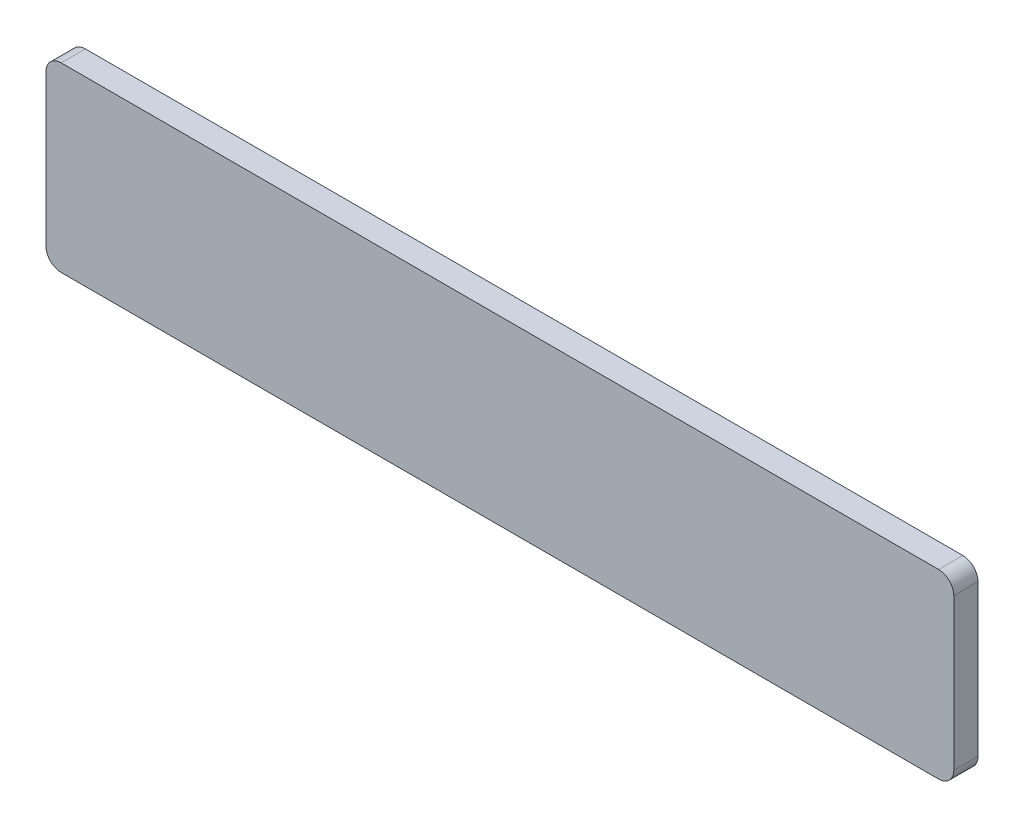
ISO-10303-21;
HEADER;
FILE_DESCRIPTION(('STEP AP214'),'2;1');
FILE_NAME('part.step','',(''),(''),'','','');
FILE_SCHEMA(('AUTOMOTIVE_DESIGN { 1 0 10303 214 1 1 1 1 }'));
ENDSEC;
DATA;
#1=APPLICATION_CONTEXT('core data for automotive mechanical design processes');
#2=APPLICATION_PROTOCOL_DEFINITION('international standard','automotive_design',2000,#1);
#3=PRODUCT_CONTEXT('',#1,'mechanical');
#4=PRODUCT('Part','Part','',(#3));
#5=PRODUCT_RELATED_PRODUCT_CATEGORY('part','',(#4));
#6=PRODUCT_DEFINITION_FORMATION('','',#4);
#7=PRODUCT_DEFINITION_CONTEXT('part definition',#1,'design');
#8=PRODUCT_DEFINITION('design','',#6,#7);
#9=PRODUCT_DEFINITION_SHAPE('','',#8);
#10=(LENGTH_UNIT() NAMED_UNIT(*) SI_UNIT(.MILLI.,.METRE.));
#11=(NAMED_UNIT(*) PLANE_ANGLE_UNIT() SI_UNIT($,.RADIAN.));
#12=(NAMED_UNIT(*) SI_UNIT($,.STERADIAN.) SOLID_ANGLE_UNIT());
#13=UNCERTAINTY_MEASURE_WITH_UNIT(LENGTH_MEASURE(1.E-05),#10,'distance_accuracy_value','');
#14=(GEOMETRIC_REPRESENTATION_CONTEXT(3) GLOBAL_UNCERTAINTY_ASSIGNED_CONTEXT((#13)) GLOBAL_UNIT_ASSIGNED_CONTEXT((#10,
#11,#12)) REPRESENTATION_CONTEXT('',''));
#15=CARTESIAN_POINT('',(0.,0.,0.));
#16=DIRECTION('',(0.,0.,1.));
#17=DIRECTION('',(1.,0.,0.));
#18=AXIS2_PLACEMENT_3D('',#15,#16,#17);
#19=CARTESIAN_POINT('',(29.5,0.5,0.8));
#20=DIRECTION('',(0.,0.,-1.));
#21=DIRECTION('',(-1.,0.,0.));
#22=AXIS2_PLACEMENT_3D('',#19,#20,#21);
#23=CYLINDRICAL_SURFACE('',#22,0.5);
#24=CARTESIAN_POINT('',(29.5,0.5,0.));
#25=DIRECTION('',(0.,0.,1.));
#26=DIRECTION('',(1.,0.,0.));
#27=AXIS2_PLACEMENT_3D('',#24,#25,#26);
#28=CIRCLE('',#27,0.5);
#29=CARTESIAN_POINT('',(29.5,0.,0.));
#30=VERTEX_POINT('',#29);
#31=CARTESIAN_POINT('',(30.,0.500000000000004,0.));
#32=VERTEX_POINT('',#31);
#33=EDGE_CURVE('E140',#30,#32,#28,.T.);
#34=ORIENTED_EDGE('',*,*,#33,.T.);
#35=DIRECTION('',(0.,0.,-1.));
#36=VECTOR('',#35,1.);
#37=CARTESIAN_POINT('',(30.,0.500000000000004,0.8));
#38=LINE('',#37,#36);
#39=CARTESIAN_POINT('',(30.,0.500000000000004,0.8));
#40=VERTEX_POINT('',#39);
#41=EDGE_CURVE('E11',#40,#32,#38,.T.);
#42=ORIENTED_EDGE('',*,*,#41,.F.);
#43=CARTESIAN_POINT('',(29.5,0.5,0.8));
#44=DIRECTION('',(0.,0.,1.));
#45=DIRECTION('',(1.,0.,0.));
#46=AXIS2_PLACEMENT_3D('',#43,#44,#45);
#47=CIRCLE('',#46,0.5);
#48=CARTESIAN_POINT('',(29.5,0.,0.8));
#49=VERTEX_POINT('',#48);
#50=EDGE_CURVE('E162',#49,#40,#47,.T.);
#51=ORIENTED_EDGE('',*,*,#50,.F.);
#52=DIRECTION('',(0.,0.,-1.));
#53=VECTOR('',#52,1.);
#54=CARTESIAN_POINT('',(29.5,0.,0.8));
#55=LINE('',#54,#53);
#56=EDGE_CURVE('E136',#49,#30,#55,.T.);
#57=ORIENTED_EDGE('',*,*,#56,.T.);
#58=EDGE_LOOP('',(#34,#42,#51,#57));
#59=FACE_BOUND('',#58,.T.);
#60=ADVANCED_FACE('F39',(#59),#23,.T.);
#61=CARTESIAN_POINT('',(30.,0.500000000000004,0.8));
#62=DIRECTION('',(-1.,0.,0.));
#63=DIRECTION('',(0.,0.,1.));
#64=AXIS2_PLACEMENT_3D('',#61,#62,#63);
#65=PLANE('',#64);
#66=DIRECTION('',(0.,1.,0.));
#67=VECTOR('',#66,1.);
#68=CARTESIAN_POINT('',(30.,0.500000000000004,0.));
#69=LINE('',#68,#67);
#70=CARTESIAN_POINT('',(30.,5.5,0.));
#71=VERTEX_POINT('',#70);
#72=EDGE_CURVE('E144',#32,#71,#69,.T.);
#73=ORIENTED_EDGE('',*,*,#72,.T.);
#74=DIRECTION('',(0.,0.,-1.));
#75=VECTOR('',#74,1.);
#76=CARTESIAN_POINT('',(30.,5.5,0.8));
#77=LINE('',#76,#75);
#78=CARTESIAN_POINT('',(30.,5.5,0.8));
#79=VERTEX_POINT('',#78);
#80=EDGE_CURVE('E48',#79,#71,#77,.T.);
#81=ORIENTED_EDGE('',*,*,#80,.F.);
#82=DIRECTION('',(0.,1.,0.));
#83=VECTOR('',#82,1.);
#84=CARTESIAN_POINT('',(30.,0.500000000000004,0.8));
#85=LINE('',#84,#83);
#86=EDGE_CURVE('E99',#40,#79,#85,.T.);
#87=ORIENTED_EDGE('',*,*,#86,.F.);
#88=ORIENTED_EDGE('',*,*,#41,.T.);
#89=EDGE_LOOP('',(#73,#81,#87,#88));
#90=FACE_BOUND('',#89,.T.);
#91=ADVANCED_FACE('F208',(#90),#65,.F.);
#92=CARTESIAN_POINT('',(29.5,5.5,0.8));
#93=DIRECTION('',(0.,0.,-1.));
#94=DIRECTION('',(-1.,0.,0.));
#95=AXIS2_PLACEMENT_3D('',#92,#93,#94);
#96=CYLINDRICAL_SURFACE('',#95,0.5);
#97=CARTESIAN_POINT('',(29.5,5.5,0.));
#98=DIRECTION('',(0.,0.,1.));
#99=DIRECTION('',(-1.,0.,0.));
#100=AXIS2_PLACEMENT_3D('',#97,#98,#99);
#101=CIRCLE('',#100,0.5);
#102=CARTESIAN_POINT('',(29.5,6.,0.));
#103=VERTEX_POINT('',#102);
#104=EDGE_CURVE('E147',#71,#103,#101,.T.);
#105=ORIENTED_EDGE('',*,*,#104,.T.);
#106=DIRECTION('',(0.,0.,-1.));
#107=VECTOR('',#106,1.);
#108=CARTESIAN_POINT('',(29.5,6.,0.8));
#109=LINE('',#108,#107);
#110=CARTESIAN_POINT('',(29.5,6.,0.8));
#111=VERTEX_POINT('',#110);
#112=EDGE_CURVE('E173',#111,#103,#109,.T.);
#113=ORIENTED_EDGE('',*,*,#112,.F.);
#114=CARTESIAN_POINT('',(29.5,5.5,0.8));
#115=DIRECTION('',(0.,0.,1.));
#116=DIRECTION('',(-1.,0.,0.));
#117=AXIS2_PLACEMENT_3D('',#114,#115,#116);
#118=CIRCLE('',#117,0.5);
#119=EDGE_CURVE('E183',#79,#111,#118,.T.);
#120=ORIENTED_EDGE('',*,*,#119,.F.);
#121=ORIENTED_EDGE('',*,*,#80,.T.);
#122=EDGE_LOOP('',(#105,#113,#120,#121));
#123=FACE_BOUND('',#122,.T.);
#124=ADVANCED_FACE('F181',(#123),#96,.T.);
#125=CARTESIAN_POINT('',(0.500000000000004,6.,0.8));
#126=DIRECTION('',(0.,-1.,0.));
#127=DIRECTION('',(0.,0.,-1.));
#128=AXIS2_PLACEMENT_3D('',#125,#126,#127);
#129=PLANE('',#128);
#130=DIRECTION('',(-1.,0.,0.));
#131=VECTOR('',#130,1.);
#132=CARTESIAN_POINT('',(0.500000000000004,6.,0.));
#133=LINE('',#132,#131);
#134=CARTESIAN_POINT('',(0.500000000000003,6.,0.));
#135=VERTEX_POINT('',#134);
#136=EDGE_CURVE('E150',#103,#135,#133,.T.);
#137=ORIENTED_EDGE('',*,*,#136,.T.);
#138=DIRECTION('',(0.,0.,-1.));
#139=VECTOR('',#138,1.);
#140=CARTESIAN_POINT('',(0.500000000000003,6.,0.8));
#141=LINE('',#140,#139);
#142=CARTESIAN_POINT('',(0.500000000000003,6.,0.8));
#143=VERTEX_POINT('',#142);
#144=EDGE_CURVE('E169',#143,#135,#141,.T.);
#145=ORIENTED_EDGE('',*,*,#144,.F.);
#146=DIRECTION('',(-1.,0.,0.));
#147=VECTOR('',#146,1.);
#148=CARTESIAN_POINT('',(0.500000000000004,6.,0.8));
#149=LINE('',#148,#147);
#150=EDGE_CURVE('E196',#111,#143,#149,.T.);
#151=ORIENTED_EDGE('',*,*,#150,.F.);
#152=ORIENTED_EDGE('',*,*,#112,.T.);
#153=EDGE_LOOP('',(#137,#145,#151,#152));
#154=FACE_BOUND('',#153,.T.);
#155=ADVANCED_FACE('F191',(#154),#129,.F.);
#156=CARTESIAN_POINT('',(0.5,5.5,0.8));
#157=DIRECTION('',(0.,0.,-1.));
#158=DIRECTION('',(-1.,0.,0.));
#159=AXIS2_PLACEMENT_3D('',#156,#157,#158);
#160=CYLINDRICAL_SURFACE('',#159,0.5);
#161=CARTESIAN_POINT('',(0.5,5.5,0.));
#162=DIRECTION('',(0.,0.,1.));
#163=DIRECTION('',(-1.,0.,0.));
#164=AXIS2_PLACEMENT_3D('',#161,#162,#163);
#165=CIRCLE('',#164,0.5);
#166=CARTESIAN_POINT('',(0.,5.5,0.));
#167=VERTEX_POINT('',#166);
#168=EDGE_CURVE('E153',#135,#167,#165,.T.);
#169=ORIENTED_EDGE('',*,*,#168,.T.);
#170=DIRECTION('',(0.,0.,-1.));
#171=VECTOR('',#170,1.);
#172=CARTESIAN_POINT('',(0.,5.5,0.8));
#173=LINE('',#172,#171);
#174=CARTESIAN_POINT('',(0.,5.5,0.8));
#175=VERTEX_POINT('',#174);
#176=EDGE_CURVE('E129',#175,#167,#173,.T.);
#177=ORIENTED_EDGE('',*,*,#176,.F.);
#178=CARTESIAN_POINT('',(0.5,5.5,0.8));
#179=DIRECTION('',(0.,0.,1.));
#180=DIRECTION('',(-1.,0.,0.));
#181=AXIS2_PLACEMENT_3D('',#178,#179,#180);
#182=CIRCLE('',#181,0.5);
#183=EDGE_CURVE('E118',#143,#175,#182,.T.);
#184=ORIENTED_EDGE('',*,*,#183,.F.);
#185=ORIENTED_EDGE('',*,*,#144,.T.);
#186=EDGE_LOOP('',(#169,#177,#184,#185));
#187=FACE_BOUND('',#186,.T.);
#188=ADVANCED_FACE('F194',(#187),#160,.T.);
#189=CARTESIAN_POINT('',(0.,0.500000000000004,0.8));
#190=DIRECTION('',(1.,0.,0.));
#191=DIRECTION('',(0.,0.,-1.));
#192=AXIS2_PLACEMENT_3D('',#189,#190,#191);
#193=PLANE('',#192);
#194=DIRECTION('',(0.,-1.,0.));
#195=VECTOR('',#194,1.);
#196=CARTESIAN_POINT('',(0.,0.500000000000004,0.));
#197=LINE('',#196,#195);
#198=CARTESIAN_POINT('',(0.,0.5,0.));
#199=VERTEX_POINT('',#198);
#200=EDGE_CURVE('E127',#167,#199,#197,.T.);
#201=ORIENTED_EDGE('',*,*,#200,.T.);
#202=DIRECTION('',(0.,0.,-1.));
#203=VECTOR('',#202,1.);
#204=CARTESIAN_POINT('',(0.,0.5,0.8));
#205=LINE('',#204,#203);
#206=CARTESIAN_POINT('',(0.,0.5,0.8));
#207=VERTEX_POINT('',#206);
#208=EDGE_CURVE('E124',#207,#199,#205,.T.);
#209=ORIENTED_EDGE('',*,*,#208,.F.);
#210=DIRECTION('',(0.,-1.,0.));
#211=VECTOR('',#210,1.);
#212=CARTESIAN_POINT('',(0.,0.500000000000004,0.8));
#213=LINE('',#212,#211);
#214=EDGE_CURVE('E112',#175,#207,#213,.T.);
#215=ORIENTED_EDGE('',*,*,#214,.F.);
#216=ORIENTED_EDGE('',*,*,#176,.T.);
#217=EDGE_LOOP('',(#201,#209,#215,#216));
#218=FACE_BOUND('',#217,.T.);
#219=ADVANCED_FACE('F125',(#218),#193,.F.);
#220=CARTESIAN_POINT('',(0.5,0.5,0.8));
#221=DIRECTION('',(0.,0.,-1.));
#222=DIRECTION('',(-1.,0.,0.));
#223=AXIS2_PLACEMENT_3D('',#220,#221,#222);
#224=CYLINDRICAL_SURFACE('',#223,0.5);
#225=CARTESIAN_POINT('',(0.5,0.5,0.));
#226=DIRECTION('',(0.,0.,1.));
#227=DIRECTION('',(-1.,0.,0.));
#228=AXIS2_PLACEMENT_3D('',#225,#226,#227);
#229=CIRCLE('',#228,0.5);
#230=CARTESIAN_POINT('',(0.500000000000004,0.,0.));
#231=VERTEX_POINT('',#230);
#232=EDGE_CURVE('E85',#199,#231,#229,.T.);
#233=ORIENTED_EDGE('',*,*,#232,.T.);
#234=DIRECTION('',(0.,0.,-1.));
#235=VECTOR('',#234,1.);
#236=CARTESIAN_POINT('',(0.500000000000004,0.,0.8));
#237=LINE('',#236,#235);
#238=CARTESIAN_POINT('',(0.500000000000004,0.,0.8));
#239=VERTEX_POINT('',#238);
#240=EDGE_CURVE('E130',#239,#231,#237,.T.);
#241=ORIENTED_EDGE('',*,*,#240,.F.);
#242=CARTESIAN_POINT('',(0.5,0.5,0.8));
#243=DIRECTION('',(0.,0.,1.));
#244=DIRECTION('',(-1.,0.,0.));
#245=AXIS2_PLACEMENT_3D('',#242,#243,#244);
#246=CIRCLE('',#245,0.5);
#247=EDGE_CURVE('E116',#207,#239,#246,.T.);
#248=ORIENTED_EDGE('',*,*,#247,.F.);
#249=ORIENTED_EDGE('',*,*,#208,.T.);
#250=EDGE_LOOP('',(#233,#241,#248,#249));
#251=FACE_BOUND('',#250,.T.);
#252=ADVANCED_FACE('F132',(#251),#224,.T.);
#253=CARTESIAN_POINT('',(0.500000000000004,0.,0.8));
#254=DIRECTION('',(0.,1.,0.));
#255=DIRECTION('',(0.,0.,1.));
#256=AXIS2_PLACEMENT_3D('',#253,#254,#255);
#257=PLANE('',#256);
#258=DIRECTION('',(1.,0.,0.));
#259=VECTOR('',#258,1.);
#260=CARTESIAN_POINT('',(0.500000000000004,0.,0.));
#261=LINE('',#260,#259);
#262=EDGE_CURVE('E91',#231,#30,#261,.T.);
#263=ORIENTED_EDGE('',*,*,#262,.T.);
#264=ORIENTED_EDGE('',*,*,#56,.F.);
#265=DIRECTION('',(1.,0.,0.));
#266=VECTOR('',#265,1.);
#267=CARTESIAN_POINT('',(0.500000000000004,0.,0.8));
#268=LINE('',#267,#266);
#269=EDGE_CURVE('E56',#239,#49,#268,.T.);
#270=ORIENTED_EDGE('',*,*,#269,.F.);
#271=ORIENTED_EDGE('',*,*,#240,.T.);
#272=EDGE_LOOP('',(#263,#264,#270,#271));
#273=FACE_BOUND('',#272,.T.);
#274=ADVANCED_FACE('F224',(#273),#257,.F.);
#275=CARTESIAN_POINT('',(29.5,0.5,0.8));
#276=DIRECTION('',(0.,0.,1.));
#277=DIRECTION('',(1.,0.,0.));
#278=AXIS2_PLACEMENT_3D('',#275,#276,#277);
#279=PLANE('',#278);
#280=ORIENTED_EDGE('',*,*,#50,.T.);
#281=ORIENTED_EDGE('',*,*,#86,.T.);
#282=ORIENTED_EDGE('',*,*,#119,.T.);
#283=ORIENTED_EDGE('',*,*,#150,.T.);
#284=ORIENTED_EDGE('',*,*,#183,.T.);
#285=ORIENTED_EDGE('',*,*,#214,.T.);
#286=ORIENTED_EDGE('',*,*,#247,.T.);
#287=ORIENTED_EDGE('',*,*,#269,.T.);
#288=EDGE_LOOP('',(#280,#281,#282,#283,#284,#285,#286,#287));
#289=FACE_BOUND('',#288,.T.);
#290=ADVANCED_FACE('F114',(#289),#279,.T.);
#291=CARTESIAN_POINT('',(29.5,0.5,0.));
#292=DIRECTION('',(0.,0.,1.));
#293=DIRECTION('',(1.,0.,0.));
#294=AXIS2_PLACEMENT_3D('',#291,#292,#293);
#295=PLANE('',#294);
#296=ORIENTED_EDGE('',*,*,#33,.F.);
#297=ORIENTED_EDGE('',*,*,#262,.F.);
#298=ORIENTED_EDGE('',*,*,#232,.F.);
#299=ORIENTED_EDGE('',*,*,#200,.F.);
#300=ORIENTED_EDGE('',*,*,#168,.F.);
#301=ORIENTED_EDGE('',*,*,#136,.F.);
#302=ORIENTED_EDGE('',*,*,#104,.F.);
#303=ORIENTED_EDGE('',*,*,#72,.F.);
#304=EDGE_LOOP('',(#296,#297,#298,#299,#300,#301,#302,#303));
#305=FACE_BOUND('',#304,.T.);
#306=ADVANCED_FACE('F187',(#305),#295,.F.);
#307=CLOSED_SHELL('',(#60,#91,#124,#155,#188,#219,#252,#274,#290,#306));
#308=MANIFOLD_SOLID_BREP('B2',#307);
#309=ADVANCED_BREP_SHAPE_REPRESENTATION('',(#18,#308),#14);
#310=SHAPE_DEFINITION_REPRESENTATION(#9,#309);
ENDSEC;
END-ISO-10303-21;
